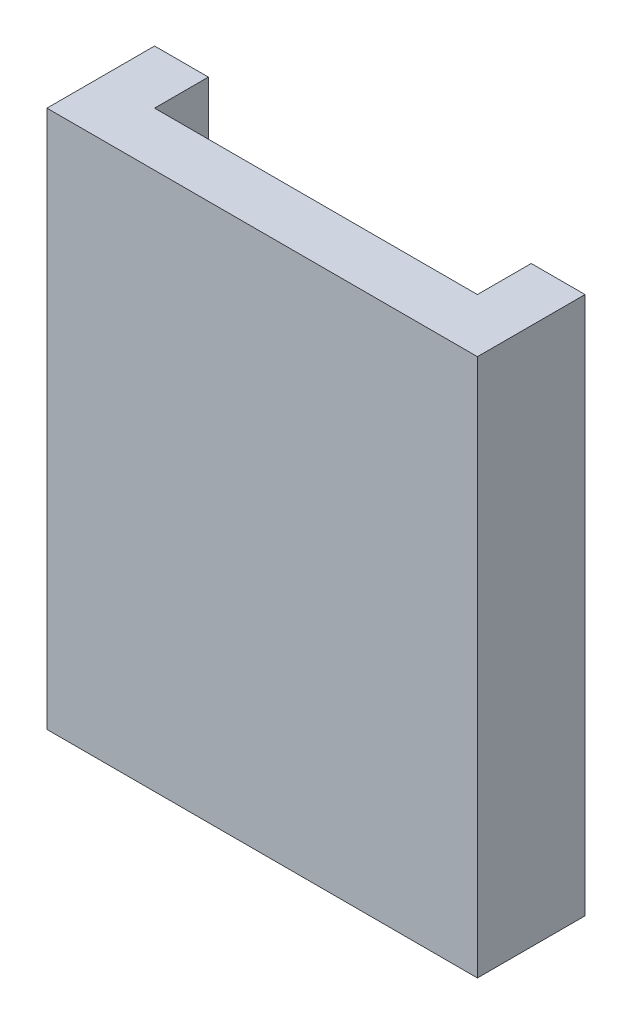
ISO-10303-21;
HEADER;
FILE_DESCRIPTION(('STEP AP214'),'2;1');
FILE_NAME('part.step','',(''),(''),'','','');
FILE_SCHEMA(('AUTOMOTIVE_DESIGN { 1 0 10303 214 1 1 1 1 }'));
ENDSEC;
DATA;
#1=APPLICATION_CONTEXT('core data for automotive mechanical design processes');
#2=APPLICATION_PROTOCOL_DEFINITION('international standard','automotive_design',2000,#1);
#3=PRODUCT_CONTEXT('',#1,'mechanical');
#4=PRODUCT('Part','Part','',(#3));
#5=PRODUCT_RELATED_PRODUCT_CATEGORY('part','',(#4));
#6=PRODUCT_DEFINITION_FORMATION('','',#4);
#7=PRODUCT_DEFINITION_CONTEXT('part definition',#1,'design');
#8=PRODUCT_DEFINITION('design','',#6,#7);
#9=PRODUCT_DEFINITION_SHAPE('','',#8);
#10=(LENGTH_UNIT() NAMED_UNIT(*) SI_UNIT(.MILLI.,.METRE.));
#11=(NAMED_UNIT(*) PLANE_ANGLE_UNIT() SI_UNIT($,.RADIAN.));
#12=(NAMED_UNIT(*) SI_UNIT($,.STERADIAN.) SOLID_ANGLE_UNIT());
#13=UNCERTAINTY_MEASURE_WITH_UNIT(LENGTH_MEASURE(1.E-05),#10,'distance_accuracy_value','');
#14=(GEOMETRIC_REPRESENTATION_CONTEXT(3) GLOBAL_UNCERTAINTY_ASSIGNED_CONTEXT((#13)) GLOBAL_UNIT_ASSIGNED_CONTEXT((#10,
#11,#12)) REPRESENTATION_CONTEXT('',''));
#15=CARTESIAN_POINT('',(0.,0.,0.));
#16=DIRECTION('',(0.,0.,1.));
#17=DIRECTION('',(1.,0.,0.));
#18=AXIS2_PLACEMENT_3D('',#15,#16,#17);
#19=CARTESIAN_POINT('',(0.,0.,0.));
#20=DIRECTION('',(0.,0.,1.));
#21=DIRECTION('',(1.,0.,0.));
#22=AXIS2_PLACEMENT_3D('',#19,#20,#21);
#23=PLANE('',#22);
#24=DIRECTION('',(-1.,0.,0.));
#25=VECTOR('',#24,1.);
#26=CARTESIAN_POINT('',(-40.,50.,0.));
#27=LINE('',#26,#25);
#28=CARTESIAN_POINT('',(-30.,50.,0.));
#29=VERTEX_POINT('',#28);
#30=CARTESIAN_POINT('',(-40.,50.,0.));
#31=VERTEX_POINT('',#30);
#32=EDGE_CURVE('E154',#29,#31,#27,.T.);
#33=ORIENTED_EDGE('',*,*,#32,.F.);
#34=DIRECTION('',(0.,1.,0.));
#35=VECTOR('',#34,1.);
#36=CARTESIAN_POINT('',(-30.,-50.,0.));
#37=LINE('',#36,#35);
#38=CARTESIAN_POINT('',(-30.,-50.,0.));
#39=VERTEX_POINT('',#38);
#40=EDGE_CURVE('E139',#39,#29,#37,.T.);
#41=ORIENTED_EDGE('',*,*,#40,.F.);
#42=DIRECTION('',(1.,0.,0.));
#43=VECTOR('',#42,1.);
#44=CARTESIAN_POINT('',(-40.,-50.,0.));
#45=LINE('',#44,#43);
#46=CARTESIAN_POINT('',(-40.,-50.,0.));
#47=VERTEX_POINT('',#46);
#48=EDGE_CURVE('E131',#47,#39,#45,.T.);
#49=ORIENTED_EDGE('',*,*,#48,.F.);
#50=DIRECTION('',(0.,-1.,0.));
#51=VECTOR('',#50,1.);
#52=CARTESIAN_POINT('',(-40.,50.,0.));
#53=LINE('',#52,#51);
#54=EDGE_CURVE('E158',#31,#47,#53,.T.);
#55=ORIENTED_EDGE('',*,*,#54,.F.);
#56=EDGE_LOOP('',(#33,#41,#49,#55));
#57=FACE_BOUND('',#56,.T.);
#58=ADVANCED_FACE('F35',(#57),#23,.F.);
#59=CARTESIAN_POINT('',(40.,50.,20.));
#60=DIRECTION('',(-1.,0.,0.));
#61=DIRECTION('',(0.,-1.,0.));
#62=AXIS2_PLACEMENT_3D('',#59,#60,#61);
#63=PLANE('',#62);
#64=DIRECTION('',(0.,1.,0.));
#65=VECTOR('',#64,1.);
#66=CARTESIAN_POINT('',(40.,50.,0.));
#67=LINE('',#66,#65);
#68=CARTESIAN_POINT('',(40.,-50.,0.));
#69=VERTEX_POINT('',#68);
#70=CARTESIAN_POINT('',(40.,50.,0.));
#71=VERTEX_POINT('',#70);
#72=EDGE_CURVE('E141',#69,#71,#67,.T.);
#73=ORIENTED_EDGE('',*,*,#72,.T.);
#74=DIRECTION('',(0.,0.,-1.));
#75=VECTOR('',#74,1.);
#76=CARTESIAN_POINT('',(40.,50.,20.));
#77=LINE('',#76,#75);
#78=CARTESIAN_POINT('',(40.,50.,20.));
#79=VERTEX_POINT('',#78);
#80=EDGE_CURVE('E11',#79,#71,#77,.T.);
#81=ORIENTED_EDGE('',*,*,#80,.F.);
#82=DIRECTION('',(0.,1.,0.));
#83=VECTOR('',#82,1.);
#84=CARTESIAN_POINT('',(40.,50.,20.));
#85=LINE('',#84,#83);
#86=CARTESIAN_POINT('',(40.,-50.,20.));
#87=VERTEX_POINT('',#86);
#88=EDGE_CURVE('E145',#87,#79,#85,.T.);
#89=ORIENTED_EDGE('',*,*,#88,.F.);
#90=DIRECTION('',(0.,0.,-1.));
#91=VECTOR('',#90,1.);
#92=CARTESIAN_POINT('',(40.,-50.,20.));
#93=LINE('',#92,#91);
#94=EDGE_CURVE('E151',#87,#69,#93,.T.);
#95=ORIENTED_EDGE('',*,*,#94,.T.);
#96=EDGE_LOOP('',(#73,#81,#89,#95));
#97=FACE_BOUND('',#96,.T.);
#98=ADVANCED_FACE('F37',(#97),#63,.F.);
#99=CARTESIAN_POINT('',(-40.,50.,20.));
#100=DIRECTION('',(0.,-1.,0.));
#101=DIRECTION('',(0.,0.,-1.));
#102=AXIS2_PLACEMENT_3D('',#99,#100,#101);
#103=PLANE('',#102);
#104=DIRECTION('',(1.,0.,0.));
#105=VECTOR('',#104,1.);
#106=CARTESIAN_POINT('',(-30.,50.,10.));
#107=LINE('',#106,#105);
#108=CARTESIAN_POINT('',(-30.,50.,10.));
#109=VERTEX_POINT('',#108);
#110=CARTESIAN_POINT('',(30.,50.,10.));
#111=VERTEX_POINT('',#110);
#112=EDGE_CURVE('E133',#109,#111,#107,.T.);
#113=ORIENTED_EDGE('',*,*,#112,.F.);
#114=DIRECTION('',(0.,0.,1.));
#115=VECTOR('',#114,1.);
#116=CARTESIAN_POINT('',(-30.,50.,0.));
#117=LINE('',#116,#115);
#118=EDGE_CURVE('E115',#29,#109,#117,.T.);
#119=ORIENTED_EDGE('',*,*,#118,.F.);
#120=ORIENTED_EDGE('',*,*,#32,.T.);
#121=DIRECTION('',(0.,0.,-1.));
#122=VECTOR('',#121,1.);
#123=CARTESIAN_POINT('',(-40.,50.,20.));
#124=LINE('',#123,#122);
#125=CARTESIAN_POINT('',(-40.,50.,20.));
#126=VERTEX_POINT('',#125);
#127=EDGE_CURVE('E43',#126,#31,#124,.T.);
#128=ORIENTED_EDGE('',*,*,#127,.F.);
#129=DIRECTION('',(-1.,0.,0.));
#130=VECTOR('',#129,1.);
#131=CARTESIAN_POINT('',(-40.,50.,20.));
#132=LINE('',#131,#130);
#133=EDGE_CURVE('E87',#79,#126,#132,.T.);
#134=ORIENTED_EDGE('',*,*,#133,.F.);
#135=ORIENTED_EDGE('',*,*,#80,.T.);
#136=CARTESIAN_POINT('',(30.,50.,0.));
#137=VERTEX_POINT('',#136);
#138=EDGE_CURVE('E155',#71,#137,#27,.T.);
#139=ORIENTED_EDGE('',*,*,#138,.T.);
#140=DIRECTION('',(0.,0.,-1.));
#141=VECTOR('',#140,1.);
#142=CARTESIAN_POINT('',(30.,50.,0.));
#143=LINE('',#142,#141);
#144=EDGE_CURVE('E50',#111,#137,#143,.T.);
#145=ORIENTED_EDGE('',*,*,#144,.F.);
#146=EDGE_LOOP('',(#113,#119,#120,#128,#134,#135,#139,#145));
#147=FACE_BOUND('',#146,.T.);
#148=ADVANCED_FACE('F171',(#147),#103,.F.);
#149=CARTESIAN_POINT('',(-40.,50.,20.));
#150=DIRECTION('',(1.,0.,0.));
#151=DIRECTION('',(0.,1.,0.));
#152=AXIS2_PLACEMENT_3D('',#149,#150,#151);
#153=PLANE('',#152);
#154=ORIENTED_EDGE('',*,*,#54,.T.);
#155=DIRECTION('',(0.,0.,-1.));
#156=VECTOR('',#155,1.);
#157=CARTESIAN_POINT('',(-40.,-50.,20.));
#158=LINE('',#157,#156);
#159=CARTESIAN_POINT('',(-40.,-50.,20.));
#160=VERTEX_POINT('',#159);
#161=EDGE_CURVE('E162',#160,#47,#158,.T.);
#162=ORIENTED_EDGE('',*,*,#161,.F.);
#163=DIRECTION('',(0.,-1.,0.));
#164=VECTOR('',#163,1.);
#165=CARTESIAN_POINT('',(-40.,50.,20.));
#166=LINE('',#165,#164);
#167=EDGE_CURVE('E148',#126,#160,#166,.T.);
#168=ORIENTED_EDGE('',*,*,#167,.F.);
#169=ORIENTED_EDGE('',*,*,#127,.T.);
#170=EDGE_LOOP('',(#154,#162,#168,#169));
#171=FACE_BOUND('',#170,.T.);
#172=ADVANCED_FACE('F167',(#171),#153,.F.);
#173=CARTESIAN_POINT('',(-40.,-50.,20.));
#174=DIRECTION('',(0.,1.,0.));
#175=DIRECTION('',(0.,0.,1.));
#176=AXIS2_PLACEMENT_3D('',#173,#174,#175);
#177=PLANE('',#176);
#178=ORIENTED_EDGE('',*,*,#48,.T.);
#179=DIRECTION('',(0.,0.,1.));
#180=VECTOR('',#179,1.);
#181=CARTESIAN_POINT('',(-30.,-50.,0.));
#182=LINE('',#181,#180);
#183=CARTESIAN_POINT('',(-30.,-50.,10.));
#184=VERTEX_POINT('',#183);
#185=EDGE_CURVE('E112',#39,#184,#182,.T.);
#186=ORIENTED_EDGE('',*,*,#185,.T.);
#187=DIRECTION('',(1.,0.,0.));
#188=VECTOR('',#187,1.);
#189=CARTESIAN_POINT('',(-30.,-50.,10.));
#190=LINE('',#189,#188);
#191=CARTESIAN_POINT('',(30.,-50.,10.));
#192=VERTEX_POINT('',#191);
#193=EDGE_CURVE('E123',#184,#192,#190,.T.);
#194=ORIENTED_EDGE('',*,*,#193,.T.);
#195=DIRECTION('',(0.,0.,-1.));
#196=VECTOR('',#195,1.);
#197=CARTESIAN_POINT('',(30.,-50.,0.));
#198=LINE('',#197,#196);
#199=CARTESIAN_POINT('',(30.,-50.,0.));
#200=VERTEX_POINT('',#199);
#201=EDGE_CURVE('E120',#192,#200,#198,.T.);
#202=ORIENTED_EDGE('',*,*,#201,.T.);
#203=EDGE_CURVE('E80',#200,#69,#45,.T.);
#204=ORIENTED_EDGE('',*,*,#203,.T.);
#205=ORIENTED_EDGE('',*,*,#94,.F.);
#206=DIRECTION('',(1.,0.,0.));
#207=VECTOR('',#206,1.);
#208=CARTESIAN_POINT('',(-40.,-50.,20.));
#209=LINE('',#208,#207);
#210=EDGE_CURVE('E59',#160,#87,#209,.T.);
#211=ORIENTED_EDGE('',*,*,#210,.F.);
#212=ORIENTED_EDGE('',*,*,#161,.T.);
#213=EDGE_LOOP('',(#178,#186,#194,#202,#204,#205,#211,#212));
#214=FACE_BOUND('',#213,.T.);
#215=ADVANCED_FACE('F128',(#214),#177,.F.);
#216=CARTESIAN_POINT('',(0.,0.,20.));
#217=DIRECTION('',(0.,0.,1.));
#218=DIRECTION('',(1.,0.,0.));
#219=AXIS2_PLACEMENT_3D('',#216,#217,#218);
#220=PLANE('',#219);
#221=ORIENTED_EDGE('',*,*,#88,.T.);
#222=ORIENTED_EDGE('',*,*,#133,.T.);
#223=ORIENTED_EDGE('',*,*,#167,.T.);
#224=ORIENTED_EDGE('',*,*,#210,.T.);
#225=EDGE_LOOP('',(#221,#222,#223,#224));
#226=FACE_BOUND('',#225,.T.);
#227=ADVANCED_FACE('F194',(#226),#220,.T.);
#228=ORIENTED_EDGE('',*,*,#203,.F.);
#229=DIRECTION('',(0.,1.,0.));
#230=VECTOR('',#229,1.);
#231=CARTESIAN_POINT('',(30.,-50.,0.));
#232=LINE('',#231,#230);
#233=EDGE_CURVE('E142',#200,#137,#232,.T.);
#234=ORIENTED_EDGE('',*,*,#233,.T.);
#235=ORIENTED_EDGE('',*,*,#138,.F.);
#236=ORIENTED_EDGE('',*,*,#72,.F.);
#237=EDGE_LOOP('',(#228,#234,#235,#236));
#238=FACE_BOUND('',#237,.T.);
#239=ADVANCED_FACE('F175',(#238),#23,.F.);
#240=CARTESIAN_POINT('',(-30.,-50.,0.));
#241=DIRECTION('',(-1.,0.,0.));
#242=DIRECTION('',(0.,0.,1.));
#243=AXIS2_PLACEMENT_3D('',#240,#241,#242);
#244=PLANE('',#243);
#245=ORIENTED_EDGE('',*,*,#118,.T.);
#246=DIRECTION('',(0.,1.,0.));
#247=VECTOR('',#246,1.);
#248=CARTESIAN_POINT('',(-30.,-50.,10.));
#249=LINE('',#248,#247);
#250=EDGE_CURVE('E108',#184,#109,#249,.T.);
#251=ORIENTED_EDGE('',*,*,#250,.F.);
#252=ORIENTED_EDGE('',*,*,#185,.F.);
#253=ORIENTED_EDGE('',*,*,#40,.T.);
#254=EDGE_LOOP('',(#245,#251,#252,#253));
#255=FACE_BOUND('',#254,.T.);
#256=ADVANCED_FACE('F110',(#255),#244,.F.);
#257=CARTESIAN_POINT('',(30.,-50.,0.));
#258=DIRECTION('',(1.,0.,0.));
#259=DIRECTION('',(0.,0.,-1.));
#260=AXIS2_PLACEMENT_3D('',#257,#258,#259);
#261=PLANE('',#260);
#262=ORIENTED_EDGE('',*,*,#144,.T.);
#263=ORIENTED_EDGE('',*,*,#233,.F.);
#264=ORIENTED_EDGE('',*,*,#201,.F.);
#265=DIRECTION('',(0.,1.,0.));
#266=VECTOR('',#265,1.);
#267=CARTESIAN_POINT('',(30.,-50.,10.));
#268=LINE('',#267,#266);
#269=EDGE_CURVE('E119',#192,#111,#268,.T.);
#270=ORIENTED_EDGE('',*,*,#269,.T.);
#271=EDGE_LOOP('',(#262,#263,#264,#270));
#272=FACE_BOUND('',#271,.T.);
#273=ADVANCED_FACE('F176',(#272),#261,.F.);
#274=CARTESIAN_POINT('',(-30.,-50.,10.));
#275=DIRECTION('',(0.,0.,1.));
#276=DIRECTION('',(1.,0.,0.));
#277=AXIS2_PLACEMENT_3D('',#274,#275,#276);
#278=PLANE('',#277);
#279=ORIENTED_EDGE('',*,*,#112,.T.);
#280=ORIENTED_EDGE('',*,*,#269,.F.);
#281=ORIENTED_EDGE('',*,*,#193,.F.);
#282=ORIENTED_EDGE('',*,*,#250,.T.);
#283=EDGE_LOOP('',(#279,#280,#281,#282));
#284=FACE_BOUND('',#283,.T.);
#285=ADVANCED_FACE('F124',(#284),#278,.F.);
#286=CLOSED_SHELL('',(#58,#98,#148,#172,#215,#227,#239,#256,#273,#285));
#287=MANIFOLD_SOLID_BREP('B2',#286);
#288=ADVANCED_BREP_SHAPE_REPRESENTATION('',(#18,#287),#14);
#289=SHAPE_DEFINITION_REPRESENTATION(#9,#288);
ENDSEC;
END-ISO-10303-21;
